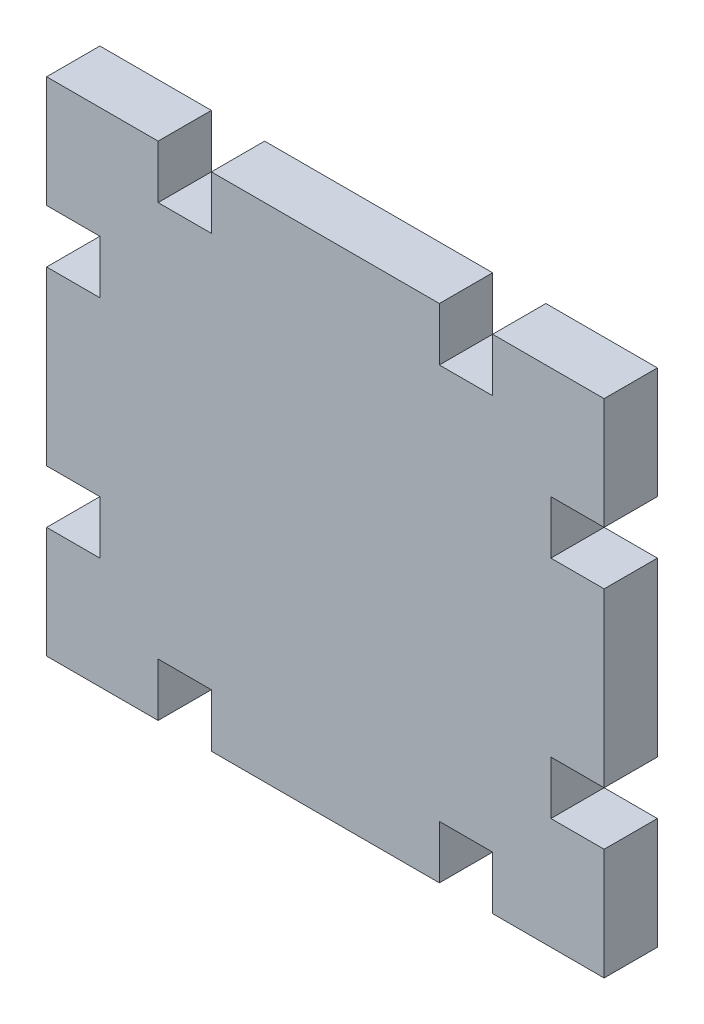
ISO-10303-21;
HEADER;
FILE_DESCRIPTION(('STEP AP214'),'2;1');
FILE_NAME('part.step','',(''),(''),'','','');
FILE_SCHEMA(('AUTOMOTIVE_DESIGN { 1 0 10303 214 1 1 1 1 }'));
ENDSEC;
DATA;
#1=APPLICATION_CONTEXT('core data for automotive mechanical design processes');
#2=APPLICATION_PROTOCOL_DEFINITION('international standard','automotive_design',2000,#1);
#3=PRODUCT_CONTEXT('',#1,'mechanical');
#4=PRODUCT('Part','Part','',(#3));
#5=PRODUCT_RELATED_PRODUCT_CATEGORY('part','',(#4));
#6=PRODUCT_DEFINITION_FORMATION('','',#4);
#7=PRODUCT_DEFINITION_CONTEXT('part definition',#1,'design');
#8=PRODUCT_DEFINITION('design','',#6,#7);
#9=PRODUCT_DEFINITION_SHAPE('','',#8);
#10=(LENGTH_UNIT() NAMED_UNIT(*) SI_UNIT(.MILLI.,.METRE.));
#11=(NAMED_UNIT(*) PLANE_ANGLE_UNIT() SI_UNIT($,.RADIAN.));
#12=(NAMED_UNIT(*) SI_UNIT($,.STERADIAN.) SOLID_ANGLE_UNIT());
#13=UNCERTAINTY_MEASURE_WITH_UNIT(LENGTH_MEASURE(1.E-05),#10,'distance_accuracy_value','');
#14=(GEOMETRIC_REPRESENTATION_CONTEXT(3) GLOBAL_UNCERTAINTY_ASSIGNED_CONTEXT((#13)) GLOBAL_UNIT_ASSIGNED_CONTEXT((#10,
#11,#12)) REPRESENTATION_CONTEXT('',''));
#15=CARTESIAN_POINT('',(0.,0.,0.));
#16=DIRECTION('',(0.,0.,1.));
#17=DIRECTION('',(1.,0.,0.));
#18=AXIS2_PLACEMENT_3D('',#15,#16,#17);
#19=CARTESIAN_POINT('',(0.,9.99999999999999,-4.7752));
#20=DIRECTION('',(-1.,0.,0.));
#21=DIRECTION('',(0.,0.,1.));
#22=AXIS2_PLACEMENT_3D('',#19,#20,#21);
#23=PLANE('',#22);
#24=DIRECTION('',(0.,-1.,0.));
#25=VECTOR('',#24,1.);
#26=CARTESIAN_POINT('',(0.,9.99999999999999,0.));
#27=LINE('',#26,#25);
#28=CARTESIAN_POINT('',(0.,9.99999999999999,0.));
#29=VERTEX_POINT('',#28);
#30=CARTESIAN_POINT('',(0.,0.,0.));
#31=VERTEX_POINT('',#30);
#32=EDGE_CURVE('E317',#29,#31,#27,.T.);
#33=ORIENTED_EDGE('',*,*,#32,.F.);
#34=DIRECTION('',(0.,0.,1.));
#35=VECTOR('',#34,1.);
#36=CARTESIAN_POINT('',(0.,9.99999999999999,-4.7752));
#37=LINE('',#36,#35);
#38=CARTESIAN_POINT('',(0.,9.99999999999999,-4.7752));
#39=VERTEX_POINT('',#38);
#40=EDGE_CURVE('E12',#39,#29,#37,.T.);
#41=ORIENTED_EDGE('',*,*,#40,.F.);
#42=DIRECTION('',(0.,-1.,0.));
#43=VECTOR('',#42,1.);
#44=CARTESIAN_POINT('',(0.,9.99999999999999,-4.7752));
#45=LINE('',#44,#43);
#46=CARTESIAN_POINT('',(0.,0.,-4.7752));
#47=VERTEX_POINT('',#46);
#48=EDGE_CURVE('E509',#39,#47,#45,.T.);
#49=ORIENTED_EDGE('',*,*,#48,.T.);
#50=DIRECTION('',(0.,0.,1.));
#51=VECTOR('',#50,1.);
#52=CARTESIAN_POINT('',(0.,0.,-4.7752));
#53=LINE('',#52,#51);
#54=EDGE_CURVE('E49',#47,#31,#53,.T.);
#55=ORIENTED_EDGE('',*,*,#54,.T.);
#56=EDGE_LOOP('',(#33,#41,#49,#55));
#57=FACE_BOUND('',#56,.T.);
#58=ADVANCED_FACE('F46',(#57),#23,.T.);
#59=CARTESIAN_POINT('',(0.,9.99999999999999,-4.7752));
#60=DIRECTION('',(0.,1.,0.));
#61=DIRECTION('',(-1.,0.,0.));
#62=AXIS2_PLACEMENT_3D('',#59,#60,#61);
#63=PLANE('',#62);
#64=DIRECTION('',(-1.,0.,0.));
#65=VECTOR('',#64,1.);
#66=CARTESIAN_POINT('',(0.,9.99999999999999,0.));
#67=LINE('',#66,#65);
#68=CARTESIAN_POINT('',(4.77520000000001,10.,0.));
#69=VERTEX_POINT('',#68);
#70=EDGE_CURVE('E505',#69,#29,#67,.T.);
#71=ORIENTED_EDGE('',*,*,#70,.F.);
#72=DIRECTION('',(0.,0.,1.));
#73=VECTOR('',#72,1.);
#74=CARTESIAN_POINT('',(4.77520000000001,10.,-4.7752));
#75=LINE('',#74,#73);
#76=CARTESIAN_POINT('',(4.77520000000001,10.,-4.7752));
#77=VERTEX_POINT('',#76);
#78=EDGE_CURVE('E56',#77,#69,#75,.T.);
#79=ORIENTED_EDGE('',*,*,#78,.F.);
#80=DIRECTION('',(-1.,0.,0.));
#81=VECTOR('',#80,1.);
#82=CARTESIAN_POINT('',(0.,9.99999999999999,-4.7752));
#83=LINE('',#82,#81);
#84=EDGE_CURVE('E303',#77,#39,#83,.T.);
#85=ORIENTED_EDGE('',*,*,#84,.T.);
#86=ORIENTED_EDGE('',*,*,#40,.T.);
#87=EDGE_LOOP('',(#71,#79,#85,#86));
#88=FACE_BOUND('',#87,.T.);
#89=ADVANCED_FACE('F615',(#88),#63,.T.);
#90=CARTESIAN_POINT('',(4.77520000000001,10.,-4.7752));
#91=DIRECTION('',(-1.,0.,0.));
#92=DIRECTION('',(0.,-1.,0.));
#93=AXIS2_PLACEMENT_3D('',#90,#91,#92);
#94=PLANE('',#93);
#95=DIRECTION('',(0.,-1.,0.));
#96=VECTOR('',#95,1.);
#97=CARTESIAN_POINT('',(4.77520000000001,10.,0.));
#98=LINE('',#97,#96);
#99=CARTESIAN_POINT('',(4.77520000000002,14.7752,0.));
#100=VERTEX_POINT('',#99);
#101=EDGE_CURVE('E289',#100,#69,#98,.T.);
#102=ORIENTED_EDGE('',*,*,#101,.F.);
#103=DIRECTION('',(0.,0.,1.));
#104=VECTOR('',#103,1.);
#105=CARTESIAN_POINT('',(4.77520000000002,14.7752,-4.7752));
#106=LINE('',#105,#104);
#107=CARTESIAN_POINT('',(4.77520000000002,14.7752,-4.7752));
#108=VERTEX_POINT('',#107);
#109=EDGE_CURVE('E284',#108,#100,#106,.T.);
#110=ORIENTED_EDGE('',*,*,#109,.F.);
#111=DIRECTION('',(0.,-1.,0.));
#112=VECTOR('',#111,1.);
#113=CARTESIAN_POINT('',(4.77520000000001,10.,-4.7752));
#114=LINE('',#113,#112);
#115=EDGE_CURVE('E287',#108,#77,#114,.T.);
#116=ORIENTED_EDGE('',*,*,#115,.T.);
#117=ORIENTED_EDGE('',*,*,#78,.T.);
#118=EDGE_LOOP('',(#102,#110,#116,#117));
#119=FACE_BOUND('',#118,.T.);
#120=ADVANCED_FACE('F286',(#119),#94,.T.);
#121=CARTESIAN_POINT('',(4.77520000000002,14.7752,-4.7752));
#122=DIRECTION('',(0.,-1.,0.));
#123=DIRECTION('',(1.,0.,0.));
#124=AXIS2_PLACEMENT_3D('',#121,#122,#123);
#125=PLANE('',#124);
#126=DIRECTION('',(1.,0.,0.));
#127=VECTOR('',#126,1.);
#128=CARTESIAN_POINT('',(4.77520000000002,14.7752,0.));
#129=LINE('',#128,#127);
#130=CARTESIAN_POINT('',(0.,14.7752,0.));
#131=VERTEX_POINT('',#130);
#132=EDGE_CURVE('E499',#131,#100,#129,.T.);
#133=ORIENTED_EDGE('',*,*,#132,.F.);
#134=DIRECTION('',(0.,0.,1.));
#135=VECTOR('',#134,1.);
#136=CARTESIAN_POINT('',(0.,14.7752,-4.7752));
#137=LINE('',#136,#135);
#138=CARTESIAN_POINT('',(0.,14.7752,-4.7752));
#139=VERTEX_POINT('',#138);
#140=EDGE_CURVE('E295',#139,#131,#137,.T.);
#141=ORIENTED_EDGE('',*,*,#140,.F.);
#142=DIRECTION('',(1.,0.,0.));
#143=VECTOR('',#142,1.);
#144=CARTESIAN_POINT('',(4.77520000000002,14.7752,-4.7752));
#145=LINE('',#144,#143);
#146=EDGE_CURVE('E301',#139,#108,#145,.T.);
#147=ORIENTED_EDGE('',*,*,#146,.T.);
#148=ORIENTED_EDGE('',*,*,#109,.T.);
#149=EDGE_LOOP('',(#133,#141,#147,#148));
#150=FACE_BOUND('',#149,.T.);
#151=ADVANCED_FACE('F306',(#150),#125,.T.);
#152=CARTESIAN_POINT('',(0.,30.2248,-4.7752));
#153=DIRECTION('',(-1.,0.,0.));
#154=DIRECTION('',(0.,0.,1.));
#155=AXIS2_PLACEMENT_3D('',#152,#153,#154);
#156=PLANE('',#155);
#157=DIRECTION('',(0.,-1.,0.));
#158=VECTOR('',#157,1.);
#159=CARTESIAN_POINT('',(0.,30.2248,0.));
#160=LINE('',#159,#158);
#161=CARTESIAN_POINT('',(0.,30.2248,0.));
#162=VERTEX_POINT('',#161);
#163=EDGE_CURVE('E494',#162,#131,#160,.T.);
#164=ORIENTED_EDGE('',*,*,#163,.F.);
#165=DIRECTION('',(0.,0.,1.));
#166=VECTOR('',#165,1.);
#167=CARTESIAN_POINT('',(0.,30.2248,-4.7752));
#168=LINE('',#167,#166);
#169=CARTESIAN_POINT('',(0.,30.2248,-4.7752));
#170=VERTEX_POINT('',#169);
#171=EDGE_CURVE('E515',#170,#162,#168,.T.);
#172=ORIENTED_EDGE('',*,*,#171,.F.);
#173=DIRECTION('',(0.,-1.,0.));
#174=VECTOR('',#173,1.);
#175=CARTESIAN_POINT('',(0.,30.2248,-4.7752));
#176=LINE('',#175,#174);
#177=EDGE_CURVE('E308',#170,#139,#176,.T.);
#178=ORIENTED_EDGE('',*,*,#177,.T.);
#179=ORIENTED_EDGE('',*,*,#140,.T.);
#180=EDGE_LOOP('',(#164,#172,#178,#179));
#181=FACE_BOUND('',#180,.T.);
#182=ADVANCED_FACE('F628',(#181),#156,.T.);
#183=CARTESIAN_POINT('',(4.77520000000001,30.2248,-4.7752));
#184=DIRECTION('',(0.,1.,0.));
#185=DIRECTION('',(0.,0.,1.));
#186=AXIS2_PLACEMENT_3D('',#183,#184,#185);
#187=PLANE('',#186);
#188=DIRECTION('',(-1.,0.,0.));
#189=VECTOR('',#188,1.);
#190=CARTESIAN_POINT('',(4.77520000000001,30.2248,0.));
#191=LINE('',#190,#189);
#192=CARTESIAN_POINT('',(4.77520000000001,30.2248,0.));
#193=VERTEX_POINT('',#192);
#194=EDGE_CURVE('E489',#193,#162,#191,.T.);
#195=ORIENTED_EDGE('',*,*,#194,.F.);
#196=DIRECTION('',(0.,0.,1.));
#197=VECTOR('',#196,1.);
#198=CARTESIAN_POINT('',(4.77520000000001,30.2248,-4.7752));
#199=LINE('',#198,#197);
#200=CARTESIAN_POINT('',(4.77520000000001,30.2248,-4.7752));
#201=VERTEX_POINT('',#200);
#202=EDGE_CURVE('E518',#201,#193,#199,.T.);
#203=ORIENTED_EDGE('',*,*,#202,.F.);
#204=DIRECTION('',(-1.,0.,0.));
#205=VECTOR('',#204,1.);
#206=CARTESIAN_POINT('',(4.77520000000001,30.2248,-4.7752));
#207=LINE('',#206,#205);
#208=EDGE_CURVE('E311',#201,#170,#207,.T.);
#209=ORIENTED_EDGE('',*,*,#208,.T.);
#210=ORIENTED_EDGE('',*,*,#171,.T.);
#211=EDGE_LOOP('',(#195,#203,#209,#210));
#212=FACE_BOUND('',#211,.T.);
#213=ADVANCED_FACE('F631',(#212),#187,.T.);
#214=CARTESIAN_POINT('',(4.7752,35.,-4.7752));
#215=DIRECTION('',(-1.,0.,0.));
#216=DIRECTION('',(0.,-1.,0.));
#217=AXIS2_PLACEMENT_3D('',#214,#215,#216);
#218=PLANE('',#217);
#219=DIRECTION('',(0.,-1.,0.));
#220=VECTOR('',#219,1.);
#221=CARTESIAN_POINT('',(4.7752,35.,0.));
#222=LINE('',#221,#220);
#223=CARTESIAN_POINT('',(4.7752,35.,0.));
#224=VERTEX_POINT('',#223);
#225=EDGE_CURVE('E485',#224,#193,#222,.T.);
#226=ORIENTED_EDGE('',*,*,#225,.F.);
#227=DIRECTION('',(0.,0.,1.));
#228=VECTOR('',#227,1.);
#229=CARTESIAN_POINT('',(4.7752,35.,-4.7752));
#230=LINE('',#229,#228);
#231=CARTESIAN_POINT('',(4.7752,35.,-4.7752));
#232=VERTEX_POINT('',#231);
#233=EDGE_CURVE('E521',#232,#224,#230,.T.);
#234=ORIENTED_EDGE('',*,*,#233,.F.);
#235=DIRECTION('',(0.,-1.,0.));
#236=VECTOR('',#235,1.);
#237=CARTESIAN_POINT('',(4.7752,35.,-4.7752));
#238=LINE('',#237,#236);
#239=EDGE_CURVE('E1103',#232,#201,#238,.T.);
#240=ORIENTED_EDGE('',*,*,#239,.T.);
#241=ORIENTED_EDGE('',*,*,#202,.T.);
#242=EDGE_LOOP('',(#226,#234,#240,#241));
#243=FACE_BOUND('',#242,.T.);
#244=ADVANCED_FACE('F635',(#243),#218,.T.);
#245=CARTESIAN_POINT('',(0.,35.,-4.7752));
#246=DIRECTION('',(0.,-1.,0.));
#247=DIRECTION('',(1.,0.,0.));
#248=AXIS2_PLACEMENT_3D('',#245,#246,#247);
#249=PLANE('',#248);
#250=DIRECTION('',(1.,0.,0.));
#251=VECTOR('',#250,1.);
#252=CARTESIAN_POINT('',(0.,35.,0.));
#253=LINE('',#252,#251);
#254=CARTESIAN_POINT('',(0.,35.,0.));
#255=VERTEX_POINT('',#254);
#256=EDGE_CURVE('E477',#255,#224,#253,.T.);
#257=ORIENTED_EDGE('',*,*,#256,.F.);
#258=DIRECTION('',(0.,0.,1.));
#259=VECTOR('',#258,1.);
#260=CARTESIAN_POINT('',(0.,35.,-4.7752));
#261=LINE('',#260,#259);
#262=CARTESIAN_POINT('',(0.,35.,-4.7752));
#263=VERTEX_POINT('',#262);
#264=EDGE_CURVE('E524',#263,#255,#261,.T.);
#265=ORIENTED_EDGE('',*,*,#264,.F.);
#266=DIRECTION('',(1.,0.,0.));
#267=VECTOR('',#266,1.);
#268=CARTESIAN_POINT('',(0.,35.,-4.7752));
#269=LINE('',#268,#267);
#270=EDGE_CURVE('E1099',#263,#232,#269,.T.);
#271=ORIENTED_EDGE('',*,*,#270,.T.);
#272=ORIENTED_EDGE('',*,*,#233,.T.);
#273=EDGE_LOOP('',(#257,#265,#271,#272));
#274=FACE_BOUND('',#273,.T.);
#275=ADVANCED_FACE('F639',(#274),#249,.T.);
#276=CARTESIAN_POINT('',(0.,35.,-4.7752));
#277=DIRECTION('',(-1.,0.,0.));
#278=DIRECTION('',(0.,0.,1.));
#279=AXIS2_PLACEMENT_3D('',#276,#277,#278);
#280=PLANE('',#279);
#281=DIRECTION('',(0.,-1.,0.));
#282=VECTOR('',#281,1.);
#283=CARTESIAN_POINT('',(0.,35.,0.));
#284=LINE('',#283,#282);
#285=CARTESIAN_POINT('',(0.,45.,0.));
#286=VERTEX_POINT('',#285);
#287=EDGE_CURVE('E472',#286,#255,#284,.T.);
#288=ORIENTED_EDGE('',*,*,#287,.F.);
#289=DIRECTION('',(0.,0.,1.));
#290=VECTOR('',#289,1.);
#291=CARTESIAN_POINT('',(0.,45.,-4.7752));
#292=LINE('',#291,#290);
#293=CARTESIAN_POINT('',(0.,45.,-4.7752));
#294=VERTEX_POINT('',#293);
#295=EDGE_CURVE('E527',#294,#286,#292,.T.);
#296=ORIENTED_EDGE('',*,*,#295,.F.);
#297=DIRECTION('',(0.,-1.,0.));
#298=VECTOR('',#297,1.);
#299=CARTESIAN_POINT('',(0.,35.,-4.7752));
#300=LINE('',#299,#298);
#301=EDGE_CURVE('E1095',#294,#263,#300,.T.);
#302=ORIENTED_EDGE('',*,*,#301,.T.);
#303=ORIENTED_EDGE('',*,*,#264,.T.);
#304=EDGE_LOOP('',(#288,#296,#302,#303));
#305=FACE_BOUND('',#304,.T.);
#306=ADVANCED_FACE('F643',(#305),#280,.T.);
#307=CARTESIAN_POINT('',(9.99999999999999,45.,-4.7752));
#308=DIRECTION('',(0.,1.,0.));
#309=DIRECTION('',(-1.,0.,0.));
#310=AXIS2_PLACEMENT_3D('',#307,#308,#309);
#311=PLANE('',#310);
#312=DIRECTION('',(-1.,0.,0.));
#313=VECTOR('',#312,1.);
#314=CARTESIAN_POINT('',(9.99999999999999,45.,0.));
#315=LINE('',#314,#313);
#316=CARTESIAN_POINT('',(9.99999999999999,45.,0.));
#317=VERTEX_POINT('',#316);
#318=EDGE_CURVE('E467',#317,#286,#315,.T.);
#319=ORIENTED_EDGE('',*,*,#318,.F.);
#320=DIRECTION('',(0.,0.,1.));
#321=VECTOR('',#320,1.);
#322=CARTESIAN_POINT('',(9.99999999999999,45.,-4.7752));
#323=LINE('',#322,#321);
#324=CARTESIAN_POINT('',(9.99999999999999,45.,-4.7752));
#325=VERTEX_POINT('',#324);
#326=EDGE_CURVE('E530',#325,#317,#323,.T.);
#327=ORIENTED_EDGE('',*,*,#326,.F.);
#328=DIRECTION('',(-1.,0.,0.));
#329=VECTOR('',#328,1.);
#330=CARTESIAN_POINT('',(9.99999999999999,45.,-4.7752));
#331=LINE('',#330,#329);
#332=EDGE_CURVE('E1091',#325,#294,#331,.T.);
#333=ORIENTED_EDGE('',*,*,#332,.T.);
#334=ORIENTED_EDGE('',*,*,#295,.T.);
#335=EDGE_LOOP('',(#319,#327,#333,#334));
#336=FACE_BOUND('',#335,.T.);
#337=ADVANCED_FACE('F647',(#336),#311,.T.);
#338=CARTESIAN_POINT('',(9.99999999999999,45.,-4.7752));
#339=DIRECTION('',(1.,0.,0.));
#340=DIRECTION('',(0.,1.,0.));
#341=AXIS2_PLACEMENT_3D('',#338,#339,#340);
#342=PLANE('',#341);
#343=DIRECTION('',(0.,1.,0.));
#344=VECTOR('',#343,1.);
#345=CARTESIAN_POINT('',(9.99999999999999,45.,0.));
#346=LINE('',#345,#344);
#347=CARTESIAN_POINT('',(9.99999999999999,40.2248,0.));
#348=VERTEX_POINT('',#347);
#349=EDGE_CURVE('E463',#348,#317,#346,.T.);
#350=ORIENTED_EDGE('',*,*,#349,.F.);
#351=DIRECTION('',(0.,0.,1.));
#352=VECTOR('',#351,1.);
#353=CARTESIAN_POINT('',(9.99999999999999,40.2248,-4.7752));
#354=LINE('',#353,#352);
#355=CARTESIAN_POINT('',(9.99999999999999,40.2248,-4.7752));
#356=VERTEX_POINT('',#355);
#357=EDGE_CURVE('E533',#356,#348,#354,.T.);
#358=ORIENTED_EDGE('',*,*,#357,.F.);
#359=DIRECTION('',(0.,1.,0.));
#360=VECTOR('',#359,1.);
#361=CARTESIAN_POINT('',(9.99999999999999,45.,-4.7752));
#362=LINE('',#361,#360);
#363=EDGE_CURVE('E1087',#356,#325,#362,.T.);
#364=ORIENTED_EDGE('',*,*,#363,.T.);
#365=ORIENTED_EDGE('',*,*,#326,.T.);
#366=EDGE_LOOP('',(#350,#358,#364,#365));
#367=FACE_BOUND('',#366,.T.);
#368=ADVANCED_FACE('F651',(#367),#342,.T.);
#369=CARTESIAN_POINT('',(9.99999999999999,40.2248,-4.7752));
#370=DIRECTION('',(0.,1.,0.));
#371=DIRECTION('',(0.,0.,1.));
#372=AXIS2_PLACEMENT_3D('',#369,#370,#371);
#373=PLANE('',#372);
#374=DIRECTION('',(-1.,0.,0.));
#375=VECTOR('',#374,1.);
#376=CARTESIAN_POINT('',(9.99999999999999,40.2248,0.));
#377=LINE('',#376,#375);
#378=CARTESIAN_POINT('',(14.7752,40.2248,0.));
#379=VERTEX_POINT('',#378);
#380=EDGE_CURVE('E455',#379,#348,#377,.T.);
#381=ORIENTED_EDGE('',*,*,#380,.F.);
#382=DIRECTION('',(0.,0.,1.));
#383=VECTOR('',#382,1.);
#384=CARTESIAN_POINT('',(14.7752,40.2248,-4.7752));
#385=LINE('',#384,#383);
#386=CARTESIAN_POINT('',(14.7752,40.2248,-4.7752));
#387=VERTEX_POINT('',#386);
#388=EDGE_CURVE('E536',#387,#379,#385,.T.);
#389=ORIENTED_EDGE('',*,*,#388,.F.);
#390=DIRECTION('',(-1.,0.,0.));
#391=VECTOR('',#390,1.);
#392=CARTESIAN_POINT('',(9.99999999999999,40.2248,-4.7752));
#393=LINE('',#392,#391);
#394=EDGE_CURVE('E1083',#387,#356,#393,.T.);
#395=ORIENTED_EDGE('',*,*,#394,.T.);
#396=ORIENTED_EDGE('',*,*,#357,.T.);
#397=EDGE_LOOP('',(#381,#389,#395,#396));
#398=FACE_BOUND('',#397,.T.);
#399=ADVANCED_FACE('F655',(#398),#373,.T.);
#400=CARTESIAN_POINT('',(14.7752,40.2248,-4.7752));
#401=DIRECTION('',(-1.,0.,0.));
#402=DIRECTION('',(0.,-1.,0.));
#403=AXIS2_PLACEMENT_3D('',#400,#401,#402);
#404=PLANE('',#403);
#405=DIRECTION('',(0.,-1.,0.));
#406=VECTOR('',#405,1.);
#407=CARTESIAN_POINT('',(14.7752,40.2248,0.));
#408=LINE('',#407,#406);
#409=CARTESIAN_POINT('',(14.7752,45.,0.));
#410=VERTEX_POINT('',#409);
#411=EDGE_CURVE('E450',#410,#379,#408,.T.);
#412=ORIENTED_EDGE('',*,*,#411,.F.);
#413=DIRECTION('',(0.,0.,1.));
#414=VECTOR('',#413,1.);
#415=CARTESIAN_POINT('',(14.7752,45.,-4.7752));
#416=LINE('',#415,#414);
#417=CARTESIAN_POINT('',(14.7752,45.,-4.7752));
#418=VERTEX_POINT('',#417);
#419=EDGE_CURVE('E539',#418,#410,#416,.T.);
#420=ORIENTED_EDGE('',*,*,#419,.F.);
#421=DIRECTION('',(0.,-1.,0.));
#422=VECTOR('',#421,1.);
#423=CARTESIAN_POINT('',(14.7752,40.2248,-4.7752));
#424=LINE('',#423,#422);
#425=EDGE_CURVE('E1079',#418,#387,#424,.T.);
#426=ORIENTED_EDGE('',*,*,#425,.T.);
#427=ORIENTED_EDGE('',*,*,#388,.T.);
#428=EDGE_LOOP('',(#412,#420,#426,#427));
#429=FACE_BOUND('',#428,.T.);
#430=ADVANCED_FACE('F659',(#429),#404,.T.);
#431=CARTESIAN_POINT('',(14.7752,45.,-4.7752));
#432=DIRECTION('',(0.,1.,0.));
#433=DIRECTION('',(-1.,0.,0.));
#434=AXIS2_PLACEMENT_3D('',#431,#432,#433);
#435=PLANE('',#434);
#436=DIRECTION('',(-1.,0.,0.));
#437=VECTOR('',#436,1.);
#438=CARTESIAN_POINT('',(14.7752,45.,0.));
#439=LINE('',#438,#437);
#440=CARTESIAN_POINT('',(35.2248,45.,0.));
#441=VERTEX_POINT('',#440);
#442=EDGE_CURVE('E445',#441,#410,#439,.T.);
#443=ORIENTED_EDGE('',*,*,#442,.F.);
#444=DIRECTION('',(0.,0.,1.));
#445=VECTOR('',#444,1.);
#446=CARTESIAN_POINT('',(35.2248,45.,-4.7752));
#447=LINE('',#446,#445);
#448=CARTESIAN_POINT('',(35.2248,45.,-4.7752));
#449=VERTEX_POINT('',#448);
#450=EDGE_CURVE('E542',#449,#441,#447,.T.);
#451=ORIENTED_EDGE('',*,*,#450,.F.);
#452=DIRECTION('',(-1.,0.,0.));
#453=VECTOR('',#452,1.);
#454=CARTESIAN_POINT('',(14.7752,45.,-4.7752));
#455=LINE('',#454,#453);
#456=EDGE_CURVE('E1075',#449,#418,#455,.T.);
#457=ORIENTED_EDGE('',*,*,#456,.T.);
#458=ORIENTED_EDGE('',*,*,#419,.T.);
#459=EDGE_LOOP('',(#443,#451,#457,#458));
#460=FACE_BOUND('',#459,.T.);
#461=ADVANCED_FACE('F663',(#460),#435,.T.);
#462=CARTESIAN_POINT('',(35.2248,40.2248,-4.7752));
#463=DIRECTION('',(1.,0.,0.));
#464=DIRECTION('',(0.,0.,-1.));
#465=AXIS2_PLACEMENT_3D('',#462,#463,#464);
#466=PLANE('',#465);
#467=DIRECTION('',(0.,1.,0.));
#468=VECTOR('',#467,1.);
#469=CARTESIAN_POINT('',(35.2248,40.2248,0.));
#470=LINE('',#469,#468);
#471=CARTESIAN_POINT('',(35.2248,40.2248,0.));
#472=VERTEX_POINT('',#471);
#473=EDGE_CURVE('E441',#472,#441,#470,.T.);
#474=ORIENTED_EDGE('',*,*,#473,.F.);
#475=DIRECTION('',(0.,0.,1.));
#476=VECTOR('',#475,1.);
#477=CARTESIAN_POINT('',(35.2248,40.2248,-4.7752));
#478=LINE('',#477,#476);
#479=CARTESIAN_POINT('',(35.2248,40.2248,-4.7752));
#480=VERTEX_POINT('',#479);
#481=EDGE_CURVE('E545',#480,#472,#478,.T.);
#482=ORIENTED_EDGE('',*,*,#481,.F.);
#483=DIRECTION('',(0.,1.,0.));
#484=VECTOR('',#483,1.);
#485=CARTESIAN_POINT('',(35.2248,40.2248,-4.7752));
#486=LINE('',#485,#484);
#487=EDGE_CURVE('E1071',#480,#449,#486,.T.);
#488=ORIENTED_EDGE('',*,*,#487,.T.);
#489=ORIENTED_EDGE('',*,*,#450,.T.);
#490=EDGE_LOOP('',(#474,#482,#488,#489));
#491=FACE_BOUND('',#490,.T.);
#492=ADVANCED_FACE('F667',(#491),#466,.T.);
#493=CARTESIAN_POINT('',(40.,40.2248,-4.7752));
#494=DIRECTION('',(0.,1.,0.));
#495=DIRECTION('',(0.,0.,1.));
#496=AXIS2_PLACEMENT_3D('',#493,#494,#495);
#497=PLANE('',#496);
#498=DIRECTION('',(-1.,0.,0.));
#499=VECTOR('',#498,1.);
#500=CARTESIAN_POINT('',(40.,40.2248,0.));
#501=LINE('',#500,#499);
#502=CARTESIAN_POINT('',(40.,40.2248,0.));
#503=VERTEX_POINT('',#502);
#504=EDGE_CURVE('E433',#503,#472,#501,.T.);
#505=ORIENTED_EDGE('',*,*,#504,.F.);
#506=DIRECTION('',(0.,0.,1.));
#507=VECTOR('',#506,1.);
#508=CARTESIAN_POINT('',(40.,40.2248,-4.7752));
#509=LINE('',#508,#507);
#510=CARTESIAN_POINT('',(40.,40.2248,-4.7752));
#511=VERTEX_POINT('',#510);
#512=EDGE_CURVE('E548',#511,#503,#509,.T.);
#513=ORIENTED_EDGE('',*,*,#512,.F.);
#514=DIRECTION('',(-1.,0.,0.));
#515=VECTOR('',#514,1.);
#516=CARTESIAN_POINT('',(40.,40.2248,-4.7752));
#517=LINE('',#516,#515);
#518=EDGE_CURVE('E1067',#511,#480,#517,.T.);
#519=ORIENTED_EDGE('',*,*,#518,.T.);
#520=ORIENTED_EDGE('',*,*,#481,.T.);
#521=EDGE_LOOP('',(#505,#513,#519,#520));
#522=FACE_BOUND('',#521,.T.);
#523=ADVANCED_FACE('F671',(#522),#497,.T.);
#524=CARTESIAN_POINT('',(40.,45.,-4.7752));
#525=DIRECTION('',(-1.,0.,0.));
#526=DIRECTION('',(0.,0.,1.));
#527=AXIS2_PLACEMENT_3D('',#524,#525,#526);
#528=PLANE('',#527);
#529=DIRECTION('',(0.,-1.,0.));
#530=VECTOR('',#529,1.);
#531=CARTESIAN_POINT('',(40.,45.,0.));
#532=LINE('',#531,#530);
#533=CARTESIAN_POINT('',(40.,45.,0.));
#534=VERTEX_POINT('',#533);
#535=EDGE_CURVE('E428',#534,#503,#532,.T.);
#536=ORIENTED_EDGE('',*,*,#535,.F.);
#537=DIRECTION('',(0.,0.,1.));
#538=VECTOR('',#537,1.);
#539=CARTESIAN_POINT('',(40.,45.,-4.7752));
#540=LINE('',#539,#538);
#541=CARTESIAN_POINT('',(40.,45.,-4.7752));
#542=VERTEX_POINT('',#541);
#543=EDGE_CURVE('E551',#542,#534,#540,.T.);
#544=ORIENTED_EDGE('',*,*,#543,.F.);
#545=DIRECTION('',(0.,-1.,0.));
#546=VECTOR('',#545,1.);
#547=CARTESIAN_POINT('',(40.,45.,-4.7752));
#548=LINE('',#547,#546);
#549=EDGE_CURVE('E1063',#542,#511,#548,.T.);
#550=ORIENTED_EDGE('',*,*,#549,.T.);
#551=ORIENTED_EDGE('',*,*,#512,.T.);
#552=EDGE_LOOP('',(#536,#544,#550,#551));
#553=FACE_BOUND('',#552,.T.);
#554=ADVANCED_FACE('F675',(#553),#528,.T.);
#555=CARTESIAN_POINT('',(40.,45.,-4.7752));
#556=DIRECTION('',(0.,1.,0.));
#557=DIRECTION('',(-1.,0.,0.));
#558=AXIS2_PLACEMENT_3D('',#555,#556,#557);
#559=PLANE('',#558);
#560=DIRECTION('',(-1.,0.,0.));
#561=VECTOR('',#560,1.);
#562=CARTESIAN_POINT('',(40.,45.,0.));
#563=LINE('',#562,#561);
#564=CARTESIAN_POINT('',(50.,45.,0.));
#565=VERTEX_POINT('',#564);
#566=EDGE_CURVE('E423',#565,#534,#563,.T.);
#567=ORIENTED_EDGE('',*,*,#566,.F.);
#568=DIRECTION('',(0.,0.,1.));
#569=VECTOR('',#568,1.);
#570=CARTESIAN_POINT('',(50.,45.,-4.7752));
#571=LINE('',#570,#569);
#572=CARTESIAN_POINT('',(50.,45.,-4.7752));
#573=VERTEX_POINT('',#572);
#574=EDGE_CURVE('E554',#573,#565,#571,.T.);
#575=ORIENTED_EDGE('',*,*,#574,.F.);
#576=DIRECTION('',(-1.,0.,0.));
#577=VECTOR('',#576,1.);
#578=CARTESIAN_POINT('',(40.,45.,-4.7752));
#579=LINE('',#578,#577);
#580=EDGE_CURVE('E1059',#573,#542,#579,.T.);
#581=ORIENTED_EDGE('',*,*,#580,.T.);
#582=ORIENTED_EDGE('',*,*,#543,.T.);
#583=EDGE_LOOP('',(#567,#575,#581,#582));
#584=FACE_BOUND('',#583,.T.);
#585=ADVANCED_FACE('F679',(#584),#559,.T.);
#586=CARTESIAN_POINT('',(50.,45.,-4.7752));
#587=DIRECTION('',(1.,0.,0.));
#588=DIRECTION('',(0.,0.,-1.));
#589=AXIS2_PLACEMENT_3D('',#586,#587,#588);
#590=PLANE('',#589);
#591=DIRECTION('',(0.,1.,0.));
#592=VECTOR('',#591,1.);
#593=CARTESIAN_POINT('',(50.,45.,0.));
#594=LINE('',#593,#592);
#595=CARTESIAN_POINT('',(50.,35.,0.));
#596=VERTEX_POINT('',#595);
#597=EDGE_CURVE('E419',#596,#565,#594,.T.);
#598=ORIENTED_EDGE('',*,*,#597,.F.);
#599=DIRECTION('',(0.,0.,1.));
#600=VECTOR('',#599,1.);
#601=CARTESIAN_POINT('',(50.,35.,-4.7752));
#602=LINE('',#601,#600);
#603=CARTESIAN_POINT('',(50.,35.,-4.7752));
#604=VERTEX_POINT('',#603);
#605=EDGE_CURVE('E557',#604,#596,#602,.T.);
#606=ORIENTED_EDGE('',*,*,#605,.F.);
#607=DIRECTION('',(0.,1.,0.));
#608=VECTOR('',#607,1.);
#609=CARTESIAN_POINT('',(50.,45.,-4.7752));
#610=LINE('',#609,#608);
#611=EDGE_CURVE('E1055',#604,#573,#610,.T.);
#612=ORIENTED_EDGE('',*,*,#611,.T.);
#613=ORIENTED_EDGE('',*,*,#574,.T.);
#614=EDGE_LOOP('',(#598,#606,#612,#613));
#615=FACE_BOUND('',#614,.T.);
#616=ADVANCED_FACE('F683',(#615),#590,.T.);
#617=CARTESIAN_POINT('',(50.,35.,-4.7752));
#618=DIRECTION('',(0.,-1.,0.));
#619=DIRECTION('',(1.,0.,0.));
#620=AXIS2_PLACEMENT_3D('',#617,#618,#619);
#621=PLANE('',#620);
#622=DIRECTION('',(1.,0.,0.));
#623=VECTOR('',#622,1.);
#624=CARTESIAN_POINT('',(50.,35.,0.));
#625=LINE('',#624,#623);
#626=CARTESIAN_POINT('',(45.2248,35.,0.));
#627=VERTEX_POINT('',#626);
#628=EDGE_CURVE('E411',#627,#596,#625,.T.);
#629=ORIENTED_EDGE('',*,*,#628,.F.);
#630=DIRECTION('',(0.,0.,1.));
#631=VECTOR('',#630,1.);
#632=CARTESIAN_POINT('',(45.2248,35.,-4.7752));
#633=LINE('',#632,#631);
#634=CARTESIAN_POINT('',(45.2248,35.,-4.7752));
#635=VERTEX_POINT('',#634);
#636=EDGE_CURVE('E560',#635,#627,#633,.T.);
#637=ORIENTED_EDGE('',*,*,#636,.F.);
#638=DIRECTION('',(1.,0.,0.));
#639=VECTOR('',#638,1.);
#640=CARTESIAN_POINT('',(50.,35.,-4.7752));
#641=LINE('',#640,#639);
#642=EDGE_CURVE('E1051',#635,#604,#641,.T.);
#643=ORIENTED_EDGE('',*,*,#642,.T.);
#644=ORIENTED_EDGE('',*,*,#605,.T.);
#645=EDGE_LOOP('',(#629,#637,#643,#644));
#646=FACE_BOUND('',#645,.T.);
#647=ADVANCED_FACE('F687',(#646),#621,.T.);
#648=CARTESIAN_POINT('',(45.2248,35.,-4.7752));
#649=DIRECTION('',(1.,0.,0.));
#650=DIRECTION('',(0.,1.,0.));
#651=AXIS2_PLACEMENT_3D('',#648,#649,#650);
#652=PLANE('',#651);
#653=DIRECTION('',(0.,1.,0.));
#654=VECTOR('',#653,1.);
#655=CARTESIAN_POINT('',(45.2248,35.,0.));
#656=LINE('',#655,#654);
#657=CARTESIAN_POINT('',(45.2248,30.2248,0.));
#658=VERTEX_POINT('',#657);
#659=EDGE_CURVE('E406',#658,#627,#656,.T.);
#660=ORIENTED_EDGE('',*,*,#659,.F.);
#661=DIRECTION('',(0.,0.,1.));
#662=VECTOR('',#661,1.);
#663=CARTESIAN_POINT('',(45.2248,30.2248,-4.7752));
#664=LINE('',#663,#662);
#665=CARTESIAN_POINT('',(45.2248,30.2248,-4.7752));
#666=VERTEX_POINT('',#665);
#667=EDGE_CURVE('E563',#666,#658,#664,.T.);
#668=ORIENTED_EDGE('',*,*,#667,.F.);
#669=DIRECTION('',(0.,1.,0.));
#670=VECTOR('',#669,1.);
#671=CARTESIAN_POINT('',(45.2248,35.,-4.7752));
#672=LINE('',#671,#670);
#673=EDGE_CURVE('E1047',#666,#635,#672,.T.);
#674=ORIENTED_EDGE('',*,*,#673,.T.);
#675=ORIENTED_EDGE('',*,*,#636,.T.);
#676=EDGE_LOOP('',(#660,#668,#674,#675));
#677=FACE_BOUND('',#676,.T.);
#678=ADVANCED_FACE('F691',(#677),#652,.T.);
#679=CARTESIAN_POINT('',(45.2248,30.2248,-4.7752));
#680=DIRECTION('',(0.,1.,0.));
#681=DIRECTION('',(0.,0.,1.));
#682=AXIS2_PLACEMENT_3D('',#679,#680,#681);
#683=PLANE('',#682);
#684=DIRECTION('',(-1.,0.,0.));
#685=VECTOR('',#684,1.);
#686=CARTESIAN_POINT('',(45.2248,30.2248,0.));
#687=LINE('',#686,#685);
#688=CARTESIAN_POINT('',(50.,30.2248,0.));
#689=VERTEX_POINT('',#688);
#690=EDGE_CURVE('E401',#689,#658,#687,.T.);
#691=ORIENTED_EDGE('',*,*,#690,.F.);
#692=DIRECTION('',(0.,0.,1.));
#693=VECTOR('',#692,1.);
#694=CARTESIAN_POINT('',(50.,30.2248,-4.7752));
#695=LINE('',#694,#693);
#696=CARTESIAN_POINT('',(50.,30.2248,-4.7752));
#697=VERTEX_POINT('',#696);
#698=EDGE_CURVE('E566',#697,#689,#695,.T.);
#699=ORIENTED_EDGE('',*,*,#698,.F.);
#700=DIRECTION('',(-1.,0.,0.));
#701=VECTOR('',#700,1.);
#702=CARTESIAN_POINT('',(45.2248,30.2248,-4.7752));
#703=LINE('',#702,#701);
#704=EDGE_CURVE('E1043',#697,#666,#703,.T.);
#705=ORIENTED_EDGE('',*,*,#704,.T.);
#706=ORIENTED_EDGE('',*,*,#667,.T.);
#707=EDGE_LOOP('',(#691,#699,#705,#706));
#708=FACE_BOUND('',#707,.T.);
#709=ADVANCED_FACE('F695',(#708),#683,.T.);
#710=CARTESIAN_POINT('',(50.,30.2248,-4.7752));
#711=DIRECTION('',(1.,0.,0.));
#712=DIRECTION('',(0.,0.,-1.));
#713=AXIS2_PLACEMENT_3D('',#710,#711,#712);
#714=PLANE('',#713);
#715=DIRECTION('',(0.,1.,0.));
#716=VECTOR('',#715,1.);
#717=CARTESIAN_POINT('',(50.,30.2248,0.));
#718=LINE('',#717,#716);
#719=CARTESIAN_POINT('',(50.,14.7752,0.));
#720=VERTEX_POINT('',#719);
#721=EDGE_CURVE('E397',#720,#689,#718,.T.);
#722=ORIENTED_EDGE('',*,*,#721,.F.);
#723=DIRECTION('',(0.,0.,1.));
#724=VECTOR('',#723,1.);
#725=CARTESIAN_POINT('',(50.,14.7752,-4.7752));
#726=LINE('',#725,#724);
#727=CARTESIAN_POINT('',(50.,14.7752,-4.7752));
#728=VERTEX_POINT('',#727);
#729=EDGE_CURVE('E569',#728,#720,#726,.T.);
#730=ORIENTED_EDGE('',*,*,#729,.F.);
#731=DIRECTION('',(0.,1.,0.));
#732=VECTOR('',#731,1.);
#733=CARTESIAN_POINT('',(50.,22.5,-4.7752));
#734=LINE('',#733,#732);
#735=EDGE_CURVE('E1040',#728,#697,#734,.T.);
#736=ORIENTED_EDGE('',*,*,#735,.T.);
#737=ORIENTED_EDGE('',*,*,#698,.T.);
#738=EDGE_LOOP('',(#722,#730,#736,#737));
#739=FACE_BOUND('',#738,.T.);
#740=ADVANCED_FACE('F699',(#739),#714,.T.);
#741=CARTESIAN_POINT('',(45.2248,14.7752,-4.7752));
#742=DIRECTION('',(0.,-1.,0.));
#743=DIRECTION('',(1.,0.,0.));
#744=AXIS2_PLACEMENT_3D('',#741,#742,#743);
#745=PLANE('',#744);
#746=DIRECTION('',(1.,0.,0.));
#747=VECTOR('',#746,1.);
#748=CARTESIAN_POINT('',(45.2248,14.7752,0.));
#749=LINE('',#748,#747);
#750=CARTESIAN_POINT('',(45.2248,14.7752,0.));
#751=VERTEX_POINT('',#750);
#752=EDGE_CURVE('E389',#751,#720,#749,.T.);
#753=ORIENTED_EDGE('',*,*,#752,.F.);
#754=DIRECTION('',(0.,0.,1.));
#755=VECTOR('',#754,1.);
#756=CARTESIAN_POINT('',(45.2248,14.7752,-4.7752));
#757=LINE('',#756,#755);
#758=CARTESIAN_POINT('',(45.2248,14.7752,-4.7752));
#759=VERTEX_POINT('',#758);
#760=EDGE_CURVE('E573',#759,#751,#757,.T.);
#761=ORIENTED_EDGE('',*,*,#760,.F.);
#762=DIRECTION('',(1.,0.,0.));
#763=VECTOR('',#762,1.);
#764=CARTESIAN_POINT('',(45.2248,14.7752,-4.7752));
#765=LINE('',#764,#763);
#766=EDGE_CURVE('E1036',#759,#728,#765,.T.);
#767=ORIENTED_EDGE('',*,*,#766,.T.);
#768=ORIENTED_EDGE('',*,*,#729,.T.);
#769=EDGE_LOOP('',(#753,#761,#767,#768));
#770=FACE_BOUND('',#769,.T.);
#771=ADVANCED_FACE('F703',(#770),#745,.T.);
#772=CARTESIAN_POINT('',(45.2248,10.,-4.7752));
#773=DIRECTION('',(1.,0.,0.));
#774=DIRECTION('',(0.,1.,0.));
#775=AXIS2_PLACEMENT_3D('',#772,#773,#774);
#776=PLANE('',#775);
#777=DIRECTION('',(0.,1.,0.));
#778=VECTOR('',#777,1.);
#779=CARTESIAN_POINT('',(45.2248,10.,0.));
#780=LINE('',#779,#778);
#781=CARTESIAN_POINT('',(45.2248,10.,0.));
#782=VERTEX_POINT('',#781);
#783=EDGE_CURVE('E384',#782,#751,#780,.T.);
#784=ORIENTED_EDGE('',*,*,#783,.F.);
#785=DIRECTION('',(0.,0.,1.));
#786=VECTOR('',#785,1.);
#787=CARTESIAN_POINT('',(45.2248,10.,-4.7752));
#788=LINE('',#787,#786);
#789=CARTESIAN_POINT('',(45.2248,10.,-4.7752));
#790=VERTEX_POINT('',#789);
#791=EDGE_CURVE('E576',#790,#782,#788,.T.);
#792=ORIENTED_EDGE('',*,*,#791,.F.);
#793=DIRECTION('',(0.,1.,0.));
#794=VECTOR('',#793,1.);
#795=CARTESIAN_POINT('',(45.2248,10.,-4.7752));
#796=LINE('',#795,#794);
#797=EDGE_CURVE('E1032',#790,#759,#796,.T.);
#798=ORIENTED_EDGE('',*,*,#797,.T.);
#799=ORIENTED_EDGE('',*,*,#760,.T.);
#800=EDGE_LOOP('',(#784,#792,#798,#799));
#801=FACE_BOUND('',#800,.T.);
#802=ADVANCED_FACE('F707',(#801),#776,.T.);
#803=CARTESIAN_POINT('',(50.,10.,-4.7752));
#804=DIRECTION('',(0.,1.,0.));
#805=DIRECTION('',(-1.,0.,0.));
#806=AXIS2_PLACEMENT_3D('',#803,#804,#805);
#807=PLANE('',#806);
#808=DIRECTION('',(-1.,0.,0.));
#809=VECTOR('',#808,1.);
#810=CARTESIAN_POINT('',(50.,10.,0.));
#811=LINE('',#810,#809);
#812=CARTESIAN_POINT('',(50.,10.,0.));
#813=VERTEX_POINT('',#812);
#814=EDGE_CURVE('E379',#813,#782,#811,.T.);
#815=ORIENTED_EDGE('',*,*,#814,.F.);
#816=DIRECTION('',(0.,0.,1.));
#817=VECTOR('',#816,1.);
#818=CARTESIAN_POINT('',(50.,10.,-4.7752));
#819=LINE('',#818,#817);
#820=CARTESIAN_POINT('',(50.,10.,-4.7752));
#821=VERTEX_POINT('',#820);
#822=EDGE_CURVE('E579',#821,#813,#819,.T.);
#823=ORIENTED_EDGE('',*,*,#822,.F.);
#824=DIRECTION('',(-1.,0.,0.));
#825=VECTOR('',#824,1.);
#826=CARTESIAN_POINT('',(50.,10.,-4.7752));
#827=LINE('',#826,#825);
#828=EDGE_CURVE('E1028',#821,#790,#827,.T.);
#829=ORIENTED_EDGE('',*,*,#828,.T.);
#830=ORIENTED_EDGE('',*,*,#791,.T.);
#831=EDGE_LOOP('',(#815,#823,#829,#830));
#832=FACE_BOUND('',#831,.T.);
#833=ADVANCED_FACE('F711',(#832),#807,.T.);
#834=CARTESIAN_POINT('',(50.,10.,-4.7752));
#835=DIRECTION('',(1.,0.,0.));
#836=DIRECTION('',(0.,0.,-1.));
#837=AXIS2_PLACEMENT_3D('',#834,#835,#836);
#838=PLANE('',#837);
#839=DIRECTION('',(0.,1.,0.));
#840=VECTOR('',#839,1.);
#841=CARTESIAN_POINT('',(50.,10.,0.));
#842=LINE('',#841,#840);
#843=CARTESIAN_POINT('',(50.,0.,0.));
#844=VERTEX_POINT('',#843);
#845=EDGE_CURVE('E375',#844,#813,#842,.T.);
#846=ORIENTED_EDGE('',*,*,#845,.F.);
#847=DIRECTION('',(0.,0.,1.));
#848=VECTOR('',#847,1.);
#849=CARTESIAN_POINT('',(50.,0.,-4.7752));
#850=LINE('',#849,#848);
#851=CARTESIAN_POINT('',(50.,0.,-4.7752));
#852=VERTEX_POINT('',#851);
#853=EDGE_CURVE('E582',#852,#844,#850,.T.);
#854=ORIENTED_EDGE('',*,*,#853,.F.);
#855=DIRECTION('',(0.,1.,0.));
#856=VECTOR('',#855,1.);
#857=CARTESIAN_POINT('',(50.,10.,-4.7752));
#858=LINE('',#857,#856);
#859=EDGE_CURVE('E1024',#852,#821,#858,.T.);
#860=ORIENTED_EDGE('',*,*,#859,.T.);
#861=ORIENTED_EDGE('',*,*,#822,.T.);
#862=EDGE_LOOP('',(#846,#854,#860,#861));
#863=FACE_BOUND('',#862,.T.);
#864=ADVANCED_FACE('F715',(#863),#838,.T.);
#865=CARTESIAN_POINT('',(40.,0.,-4.7752));
#866=DIRECTION('',(0.,-1.,0.));
#867=DIRECTION('',(0.,0.,-1.));
#868=AXIS2_PLACEMENT_3D('',#865,#866,#867);
#869=PLANE('',#868);
#870=DIRECTION('',(1.,0.,0.));
#871=VECTOR('',#870,1.);
#872=CARTESIAN_POINT('',(40.,0.,0.));
#873=LINE('',#872,#871);
#874=CARTESIAN_POINT('',(40.,0.,0.));
#875=VERTEX_POINT('',#874);
#876=EDGE_CURVE('E367',#875,#844,#873,.T.);
#877=ORIENTED_EDGE('',*,*,#876,.F.);
#878=DIRECTION('',(0.,0.,1.));
#879=VECTOR('',#878,1.);
#880=CARTESIAN_POINT('',(40.,0.,-4.7752));
#881=LINE('',#880,#879);
#882=CARTESIAN_POINT('',(40.,0.,-4.7752));
#883=VERTEX_POINT('',#882);
#884=EDGE_CURVE('E585',#883,#875,#881,.T.);
#885=ORIENTED_EDGE('',*,*,#884,.F.);
#886=DIRECTION('',(1.,0.,0.));
#887=VECTOR('',#886,1.);
#888=CARTESIAN_POINT('',(40.,0.,-4.7752));
#889=LINE('',#888,#887);
#890=EDGE_CURVE('E1020',#883,#852,#889,.T.);
#891=ORIENTED_EDGE('',*,*,#890,.T.);
#892=ORIENTED_EDGE('',*,*,#853,.T.);
#893=EDGE_LOOP('',(#877,#885,#891,#892));
#894=FACE_BOUND('',#893,.T.);
#895=ADVANCED_FACE('F719',(#894),#869,.T.);
#896=CARTESIAN_POINT('',(40.,0.,-4.7752));
#897=DIRECTION('',(-1.,0.,0.));
#898=DIRECTION('',(0.,0.,1.));
#899=AXIS2_PLACEMENT_3D('',#896,#897,#898);
#900=PLANE('',#899);
#901=DIRECTION('',(0.,-1.,0.));
#902=VECTOR('',#901,1.);
#903=CARTESIAN_POINT('',(40.,0.,0.));
#904=LINE('',#903,#902);
#905=CARTESIAN_POINT('',(40.,4.7752,0.));
#906=VERTEX_POINT('',#905);
#907=EDGE_CURVE('E362',#906,#875,#904,.T.);
#908=ORIENTED_EDGE('',*,*,#907,.F.);
#909=DIRECTION('',(0.,0.,1.));
#910=VECTOR('',#909,1.);
#911=CARTESIAN_POINT('',(40.,4.7752,-4.7752));
#912=LINE('',#911,#910);
#913=CARTESIAN_POINT('',(40.,4.7752,-4.7752));
#914=VERTEX_POINT('',#913);
#915=EDGE_CURVE('E588',#914,#906,#912,.T.);
#916=ORIENTED_EDGE('',*,*,#915,.F.);
#917=DIRECTION('',(0.,-1.,0.));
#918=VECTOR('',#917,1.);
#919=CARTESIAN_POINT('',(40.,0.,-4.7752));
#920=LINE('',#919,#918);
#921=EDGE_CURVE('E1016',#914,#883,#920,.T.);
#922=ORIENTED_EDGE('',*,*,#921,.T.);
#923=ORIENTED_EDGE('',*,*,#884,.T.);
#924=EDGE_LOOP('',(#908,#916,#922,#923));
#925=FACE_BOUND('',#924,.T.);
#926=ADVANCED_FACE('F723',(#925),#900,.T.);
#927=CARTESIAN_POINT('',(40.,4.7752,-4.7752));
#928=DIRECTION('',(0.,-1.,0.));
#929=DIRECTION('',(0.,0.,-1.));
#930=AXIS2_PLACEMENT_3D('',#927,#928,#929);
#931=PLANE('',#930);
#932=DIRECTION('',(1.,0.,0.));
#933=VECTOR('',#932,1.);
#934=CARTESIAN_POINT('',(40.,4.7752,0.));
#935=LINE('',#934,#933);
#936=CARTESIAN_POINT('',(35.2248,4.7752,0.));
#937=VERTEX_POINT('',#936);
#938=EDGE_CURVE('E357',#937,#906,#935,.T.);
#939=ORIENTED_EDGE('',*,*,#938,.F.);
#940=DIRECTION('',(0.,0.,1.));
#941=VECTOR('',#940,1.);
#942=CARTESIAN_POINT('',(35.2248,4.7752,-4.7752));
#943=LINE('',#942,#941);
#944=CARTESIAN_POINT('',(35.2248,4.7752,-4.7752));
#945=VERTEX_POINT('',#944);
#946=EDGE_CURVE('E591',#945,#937,#943,.T.);
#947=ORIENTED_EDGE('',*,*,#946,.F.);
#948=DIRECTION('',(1.,0.,0.));
#949=VECTOR('',#948,1.);
#950=CARTESIAN_POINT('',(40.,4.7752,-4.7752));
#951=LINE('',#950,#949);
#952=EDGE_CURVE('E1008',#945,#914,#951,.T.);
#953=ORIENTED_EDGE('',*,*,#952,.T.);
#954=ORIENTED_EDGE('',*,*,#915,.T.);
#955=EDGE_LOOP('',(#939,#947,#953,#954));
#956=FACE_BOUND('',#955,.T.);
#957=ADVANCED_FACE('F727',(#956),#931,.T.);
#958=CARTESIAN_POINT('',(35.2248,4.7752,-4.7752));
#959=DIRECTION('',(1.,0.,0.));
#960=DIRECTION('',(0.,0.,-1.));
#961=AXIS2_PLACEMENT_3D('',#958,#959,#960);
#962=PLANE('',#961);
#963=DIRECTION('',(0.,1.,0.));
#964=VECTOR('',#963,1.);
#965=CARTESIAN_POINT('',(35.2248,4.7752,0.));
#966=LINE('',#965,#964);
#967=CARTESIAN_POINT('',(35.2248,0.,0.));
#968=VERTEX_POINT('',#967);
#969=EDGE_CURVE('E353',#968,#937,#966,.T.);
#970=ORIENTED_EDGE('',*,*,#969,.F.);
#971=DIRECTION('',(0.,0.,1.));
#972=VECTOR('',#971,1.);
#973=CARTESIAN_POINT('',(35.2248,0.,-4.7752));
#974=LINE('',#973,#972);
#975=CARTESIAN_POINT('',(35.2248,0.,-4.7752));
#976=VERTEX_POINT('',#975);
#977=EDGE_CURVE('E594',#976,#968,#974,.T.);
#978=ORIENTED_EDGE('',*,*,#977,.F.);
#979=DIRECTION('',(0.,1.,0.));
#980=VECTOR('',#979,1.);
#981=CARTESIAN_POINT('',(35.2248,4.7752,-4.7752));
#982=LINE('',#981,#980);
#983=EDGE_CURVE('E1003',#976,#945,#982,.T.);
#984=ORIENTED_EDGE('',*,*,#983,.T.);
#985=ORIENTED_EDGE('',*,*,#946,.T.);
#986=EDGE_LOOP('',(#970,#978,#984,#985));
#987=FACE_BOUND('',#986,.T.);
#988=ADVANCED_FACE('F731',(#987),#962,.T.);
#989=CARTESIAN_POINT('',(25.,0.,-4.7752));
#990=DIRECTION('',(0.,-1.,0.));
#991=DIRECTION('',(0.,0.,-1.));
#992=AXIS2_PLACEMENT_3D('',#989,#990,#991);
#993=PLANE('',#992);
#994=DIRECTION('',(1.,0.,0.));
#995=VECTOR('',#994,1.);
#996=CARTESIAN_POINT('',(25.,0.,0.));
#997=LINE('',#996,#995);
#998=CARTESIAN_POINT('',(14.7752,0.,0.));
#999=VERTEX_POINT('',#998);
#1000=EDGE_CURVE('E345',#999,#968,#997,.T.);
#1001=ORIENTED_EDGE('',*,*,#1000,.F.);
#1002=DIRECTION('',(0.,0.,1.));
#1003=VECTOR('',#1002,1.);
#1004=CARTESIAN_POINT('',(14.7752,0.,-4.7752));
#1005=LINE('',#1004,#1003);
#1006=CARTESIAN_POINT('',(14.7752,0.,-4.7752));
#1007=VERTEX_POINT('',#1006);
#1008=EDGE_CURVE('E597',#1007,#999,#1005,.T.);
#1009=ORIENTED_EDGE('',*,*,#1008,.F.);
#1010=DIRECTION('',(1.,0.,0.));
#1011=VECTOR('',#1010,1.);
#1012=CARTESIAN_POINT('',(14.7752,0.,-4.7752));
#1013=LINE('',#1012,#1011);
#1014=EDGE_CURVE('E998',#1007,#976,#1013,.T.);
#1015=ORIENTED_EDGE('',*,*,#1014,.T.);
#1016=ORIENTED_EDGE('',*,*,#977,.T.);
#1017=EDGE_LOOP('',(#1001,#1009,#1015,#1016));
#1018=FACE_BOUND('',#1017,.T.);
#1019=ADVANCED_FACE('F735',(#1018),#993,.T.);
#1020=CARTESIAN_POINT('',(14.7752,4.7752,-4.7752));
#1021=DIRECTION('',(-1.,0.,0.));
#1022=DIRECTION('',(0.,0.,1.));
#1023=AXIS2_PLACEMENT_3D('',#1020,#1021,#1022);
#1024=PLANE('',#1023);
#1025=DIRECTION('',(0.,-1.,0.));
#1026=VECTOR('',#1025,1.);
#1027=CARTESIAN_POINT('',(14.7752,4.7752,0.));
#1028=LINE('',#1027,#1026);
#1029=CARTESIAN_POINT('',(14.7752,4.7752,0.));
#1030=VERTEX_POINT('',#1029);
#1031=EDGE_CURVE('E340',#1030,#999,#1028,.T.);
#1032=ORIENTED_EDGE('',*,*,#1031,.F.);
#1033=DIRECTION('',(0.,0.,1.));
#1034=VECTOR('',#1033,1.);
#1035=CARTESIAN_POINT('',(14.7752,4.7752,-4.7752));
#1036=LINE('',#1035,#1034);
#1037=CARTESIAN_POINT('',(14.7752,4.7752,-4.7752));
#1038=VERTEX_POINT('',#1037);
#1039=EDGE_CURVE('E601',#1038,#1030,#1036,.T.);
#1040=ORIENTED_EDGE('',*,*,#1039,.F.);
#1041=DIRECTION('',(0.,-1.,0.));
#1042=VECTOR('',#1041,1.);
#1043=CARTESIAN_POINT('',(14.7752,4.7752,-4.7752));
#1044=LINE('',#1043,#1042);
#1045=EDGE_CURVE('E996',#1038,#1007,#1044,.T.);
#1046=ORIENTED_EDGE('',*,*,#1045,.T.);
#1047=ORIENTED_EDGE('',*,*,#1008,.T.);
#1048=EDGE_LOOP('',(#1032,#1040,#1046,#1047));
#1049=FACE_BOUND('',#1048,.T.);
#1050=ADVANCED_FACE('F739',(#1049),#1024,.T.);
#1051=CARTESIAN_POINT('',(10.,4.7752,-4.7752));
#1052=DIRECTION('',(0.,-1.,0.));
#1053=DIRECTION('',(0.,0.,-1.));
#1054=AXIS2_PLACEMENT_3D('',#1051,#1052,#1053);
#1055=PLANE('',#1054);
#1056=DIRECTION('',(1.,0.,0.));
#1057=VECTOR('',#1056,1.);
#1058=CARTESIAN_POINT('',(10.,4.7752,0.));
#1059=LINE('',#1058,#1057);
#1060=CARTESIAN_POINT('',(10.,4.7752,0.));
#1061=VERTEX_POINT('',#1060);
#1062=EDGE_CURVE('E335',#1061,#1030,#1059,.T.);
#1063=ORIENTED_EDGE('',*,*,#1062,.F.);
#1064=DIRECTION('',(0.,0.,1.));
#1065=VECTOR('',#1064,1.);
#1066=CARTESIAN_POINT('',(10.,4.7752,-4.7752));
#1067=LINE('',#1066,#1065);
#1068=CARTESIAN_POINT('',(10.,4.7752,-4.7752));
#1069=VERTEX_POINT('',#1068);
#1070=EDGE_CURVE('E604',#1069,#1061,#1067,.T.);
#1071=ORIENTED_EDGE('',*,*,#1070,.F.);
#1072=DIRECTION('',(1.,0.,0.));
#1073=VECTOR('',#1072,1.);
#1074=CARTESIAN_POINT('',(10.,4.7752,-4.7752));
#1075=LINE('',#1074,#1073);
#1076=EDGE_CURVE('E993',#1069,#1038,#1075,.T.);
#1077=ORIENTED_EDGE('',*,*,#1076,.T.);
#1078=ORIENTED_EDGE('',*,*,#1039,.T.);
#1079=EDGE_LOOP('',(#1063,#1071,#1077,#1078));
#1080=FACE_BOUND('',#1079,.T.);
#1081=ADVANCED_FACE('F743',(#1080),#1055,.T.);
#1082=CARTESIAN_POINT('',(10.,0.,-4.7752));
#1083=DIRECTION('',(1.,0.,0.));
#1084=DIRECTION('',(0.,0.,-1.));
#1085=AXIS2_PLACEMENT_3D('',#1082,#1083,#1084);
#1086=PLANE('',#1085);
#1087=DIRECTION('',(0.,1.,0.));
#1088=VECTOR('',#1087,1.);
#1089=CARTESIAN_POINT('',(10.,0.,0.));
#1090=LINE('',#1089,#1088);
#1091=CARTESIAN_POINT('',(10.,0.,0.));
#1092=VERTEX_POINT('',#1091);
#1093=EDGE_CURVE('E331',#1092,#1061,#1090,.T.);
#1094=ORIENTED_EDGE('',*,*,#1093,.F.);
#1095=DIRECTION('',(0.,0.,1.));
#1096=VECTOR('',#1095,1.);
#1097=CARTESIAN_POINT('',(10.,0.,-4.7752));
#1098=LINE('',#1097,#1096);
#1099=CARTESIAN_POINT('',(10.,0.,-4.7752));
#1100=VERTEX_POINT('',#1099);
#1101=EDGE_CURVE('E606',#1100,#1092,#1098,.T.);
#1102=ORIENTED_EDGE('',*,*,#1101,.F.);
#1103=DIRECTION('',(0.,1.,0.));
#1104=VECTOR('',#1103,1.);
#1105=CARTESIAN_POINT('',(10.,0.,-4.7752));
#1106=LINE('',#1105,#1104);
#1107=EDGE_CURVE('E1178',#1100,#1069,#1106,.T.);
#1108=ORIENTED_EDGE('',*,*,#1107,.T.);
#1109=ORIENTED_EDGE('',*,*,#1070,.T.);
#1110=EDGE_LOOP('',(#1094,#1102,#1108,#1109));
#1111=FACE_BOUND('',#1110,.T.);
#1112=ADVANCED_FACE('F747',(#1111),#1086,.T.);
#1113=CARTESIAN_POINT('',(10.,0.,-4.7752));
#1114=DIRECTION('',(0.,-1.,0.));
#1115=DIRECTION('',(0.,0.,-1.));
#1116=AXIS2_PLACEMENT_3D('',#1113,#1114,#1115);
#1117=PLANE('',#1116);
#1118=DIRECTION('',(1.,0.,0.));
#1119=VECTOR('',#1118,1.);
#1120=CARTESIAN_POINT('',(10.,0.,0.));
#1121=LINE('',#1120,#1119);
#1122=EDGE_CURVE('E322',#31,#1092,#1121,.T.);
#1123=ORIENTED_EDGE('',*,*,#1122,.F.);
#1124=ORIENTED_EDGE('',*,*,#54,.F.);
#1125=DIRECTION('',(1.,0.,0.));
#1126=VECTOR('',#1125,1.);
#1127=CARTESIAN_POINT('',(10.,0.,-4.7752));
#1128=LINE('',#1127,#1126);
#1129=EDGE_CURVE('E1175',#47,#1100,#1128,.T.);
#1130=ORIENTED_EDGE('',*,*,#1129,.T.);
#1131=ORIENTED_EDGE('',*,*,#1101,.T.);
#1132=EDGE_LOOP('',(#1123,#1124,#1130,#1131));
#1133=FACE_BOUND('',#1132,.T.);
#1134=ADVANCED_FACE('F611',(#1133),#1117,.T.);
#1135=CARTESIAN_POINT('',(0.,0.,-4.7752));
#1136=DIRECTION('',(0.,0.,-1.));
#1137=DIRECTION('',(-1.,0.,0.));
#1138=AXIS2_PLACEMENT_3D('',#1135,#1136,#1137);
#1139=PLANE('',#1138);
#1140=ORIENTED_EDGE('',*,*,#48,.F.);
#1141=ORIENTED_EDGE('',*,*,#84,.F.);
#1142=ORIENTED_EDGE('',*,*,#115,.F.);
#1143=ORIENTED_EDGE('',*,*,#146,.F.);
#1144=ORIENTED_EDGE('',*,*,#177,.F.);
#1145=ORIENTED_EDGE('',*,*,#208,.F.);
#1146=ORIENTED_EDGE('',*,*,#239,.F.);
#1147=ORIENTED_EDGE('',*,*,#270,.F.);
#1148=ORIENTED_EDGE('',*,*,#301,.F.);
#1149=ORIENTED_EDGE('',*,*,#332,.F.);
#1150=ORIENTED_EDGE('',*,*,#363,.F.);
#1151=ORIENTED_EDGE('',*,*,#394,.F.);
#1152=ORIENTED_EDGE('',*,*,#425,.F.);
#1153=ORIENTED_EDGE('',*,*,#456,.F.);
#1154=ORIENTED_EDGE('',*,*,#487,.F.);
#1155=ORIENTED_EDGE('',*,*,#518,.F.);
#1156=ORIENTED_EDGE('',*,*,#549,.F.);
#1157=ORIENTED_EDGE('',*,*,#580,.F.);
#1158=ORIENTED_EDGE('',*,*,#611,.F.);
#1159=ORIENTED_EDGE('',*,*,#642,.F.);
#1160=ORIENTED_EDGE('',*,*,#673,.F.);
#1161=ORIENTED_EDGE('',*,*,#704,.F.);
#1162=ORIENTED_EDGE('',*,*,#735,.F.);
#1163=ORIENTED_EDGE('',*,*,#766,.F.);
#1164=ORIENTED_EDGE('',*,*,#797,.F.);
#1165=ORIENTED_EDGE('',*,*,#828,.F.);
#1166=ORIENTED_EDGE('',*,*,#859,.F.);
#1167=ORIENTED_EDGE('',*,*,#890,.F.);
#1168=ORIENTED_EDGE('',*,*,#921,.F.);
#1169=ORIENTED_EDGE('',*,*,#952,.F.);
#1170=ORIENTED_EDGE('',*,*,#983,.F.);
#1171=ORIENTED_EDGE('',*,*,#1014,.F.);
#1172=ORIENTED_EDGE('',*,*,#1045,.F.);
#1173=ORIENTED_EDGE('',*,*,#1076,.F.);
#1174=ORIENTED_EDGE('',*,*,#1107,.F.);
#1175=ORIENTED_EDGE('',*,*,#1129,.F.);
#1176=EDGE_LOOP('',(#1140,#1141,#1142,#1143,#1144,#1145,#1146,#1147,#1148,#1149,#1150,#1151,
#1152,#1153,#1154,#1155,#1156,#1157,#1158,#1159,#1160,#1161,#1162,#1163,#1164,#1165,#1166,#1167,
#1168,#1169,#1170,#1171,#1172,#1173,#1174,#1175));
#1177=FACE_BOUND('',#1176,.T.);
#1178=ADVANCED_FACE('F299',(#1177),#1139,.T.);
#1179=CARTESIAN_POINT('',(0.,0.,0.));
#1180=DIRECTION('',(0.,0.,-1.));
#1181=DIRECTION('',(-1.,0.,0.));
#1182=AXIS2_PLACEMENT_3D('',#1179,#1180,#1181);
#1183=PLANE('',#1182);
#1184=ORIENTED_EDGE('',*,*,#32,.T.);
#1185=ORIENTED_EDGE('',*,*,#1122,.T.);
#1186=ORIENTED_EDGE('',*,*,#1093,.T.);
#1187=ORIENTED_EDGE('',*,*,#1062,.T.);
#1188=ORIENTED_EDGE('',*,*,#1031,.T.);
#1189=ORIENTED_EDGE('',*,*,#1000,.T.);
#1190=ORIENTED_EDGE('',*,*,#969,.T.);
#1191=ORIENTED_EDGE('',*,*,#938,.T.);
#1192=ORIENTED_EDGE('',*,*,#907,.T.);
#1193=ORIENTED_EDGE('',*,*,#876,.T.);
#1194=ORIENTED_EDGE('',*,*,#845,.T.);
#1195=ORIENTED_EDGE('',*,*,#814,.T.);
#1196=ORIENTED_EDGE('',*,*,#783,.T.);
#1197=ORIENTED_EDGE('',*,*,#752,.T.);
#1198=ORIENTED_EDGE('',*,*,#721,.T.);
#1199=ORIENTED_EDGE('',*,*,#690,.T.);
#1200=ORIENTED_EDGE('',*,*,#659,.T.);
#1201=ORIENTED_EDGE('',*,*,#628,.T.);
#1202=ORIENTED_EDGE('',*,*,#597,.T.);
#1203=ORIENTED_EDGE('',*,*,#566,.T.);
#1204=ORIENTED_EDGE('',*,*,#535,.T.);
#1205=ORIENTED_EDGE('',*,*,#504,.T.);
#1206=ORIENTED_EDGE('',*,*,#473,.T.);
#1207=ORIENTED_EDGE('',*,*,#442,.T.);
#1208=ORIENTED_EDGE('',*,*,#411,.T.);
#1209=ORIENTED_EDGE('',*,*,#380,.T.);
#1210=ORIENTED_EDGE('',*,*,#349,.T.);
#1211=ORIENTED_EDGE('',*,*,#318,.T.);
#1212=ORIENTED_EDGE('',*,*,#287,.T.);
#1213=ORIENTED_EDGE('',*,*,#256,.T.);
#1214=ORIENTED_EDGE('',*,*,#225,.T.);
#1215=ORIENTED_EDGE('',*,*,#194,.T.);
#1216=ORIENTED_EDGE('',*,*,#163,.T.);
#1217=ORIENTED_EDGE('',*,*,#132,.T.);
#1218=ORIENTED_EDGE('',*,*,#101,.T.);
#1219=ORIENTED_EDGE('',*,*,#70,.T.);
#1220=EDGE_LOOP('',(#1184,#1185,#1186,#1187,#1188,#1189,#1190,#1191,#1192,#1193,#1194,#1195,
#1196,#1197,#1198,#1199,#1200,#1201,#1202,#1203,#1204,#1205,#1206,#1207,#1208,#1209,#1210,#1211,
#1212,#1213,#1214,#1215,#1216,#1217,#1218,#1219));
#1221=FACE_BOUND('',#1220,.T.);
#1222=ADVANCED_FACE('F614',(#1221),#1183,.F.);
#1223=CLOSED_SHELL('',(#58,#89,#120,#151,#182,#213,#244,#275,#306,#337,#368,#399,#430,#461,#492,
#523,#554,#585,#616,#647,#678,#709,#740,#771,#802,#833,#864,#895,#926,#957,#988,#1019,#1050,
#1081,#1112,#1134,#1178,#1222));
#1224=MANIFOLD_SOLID_BREP('B2',#1223);
#1225=ADVANCED_BREP_SHAPE_REPRESENTATION('',(#18,#1224),#14);
#1226=SHAPE_DEFINITION_REPRESENTATION(#9,#1225);
ENDSEC;
END-ISO-10303-21;
